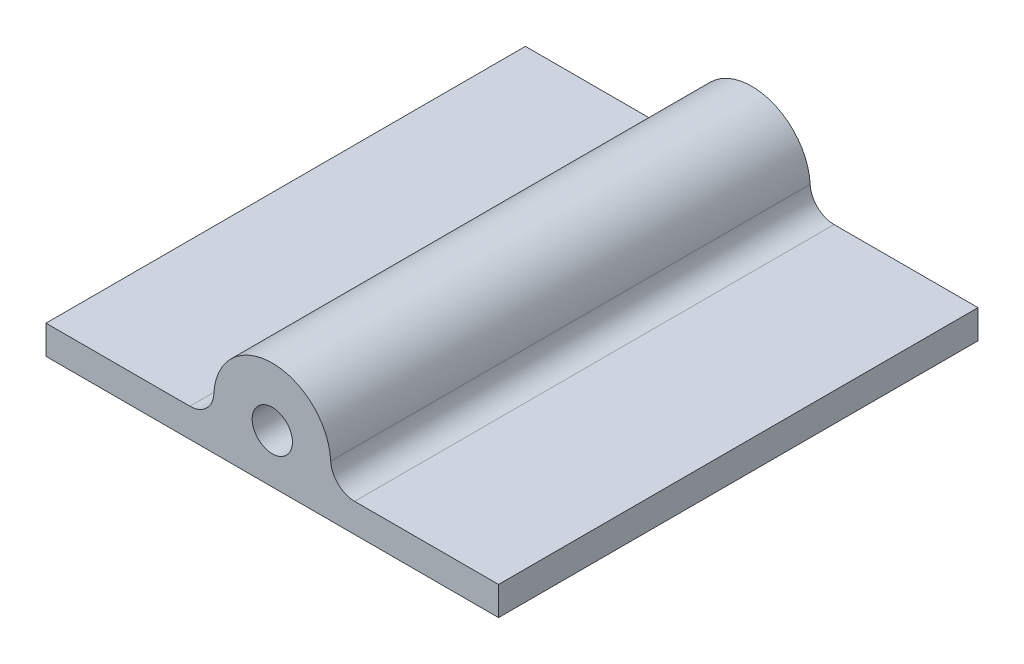
ISO-10303-21;
HEADER;
FILE_DESCRIPTION(('STEP AP214'),'2;1');
FILE_NAME('part.step','',(''),(''),'','','');
FILE_SCHEMA(('AUTOMOTIVE_DESIGN { 1 0 10303 214 1 1 1 1 }'));
ENDSEC;
DATA;
#1=APPLICATION_CONTEXT('core data for automotive mechanical design processes');
#2=APPLICATION_PROTOCOL_DEFINITION('international standard','automotive_design',2000,#1);
#3=PRODUCT_CONTEXT('',#1,'mechanical');
#4=PRODUCT('Part','Part','',(#3));
#5=PRODUCT_RELATED_PRODUCT_CATEGORY('part','',(#4));
#6=PRODUCT_DEFINITION_FORMATION('','',#4);
#7=PRODUCT_DEFINITION_CONTEXT('part definition',#1,'design');
#8=PRODUCT_DEFINITION('design','',#6,#7);
#9=PRODUCT_DEFINITION_SHAPE('','',#8);
#10=(LENGTH_UNIT() NAMED_UNIT(*) SI_UNIT(.MILLI.,.METRE.));
#11=(NAMED_UNIT(*) PLANE_ANGLE_UNIT() SI_UNIT($,.RADIAN.));
#12=(NAMED_UNIT(*) SI_UNIT($,.STERADIAN.) SOLID_ANGLE_UNIT());
#13=UNCERTAINTY_MEASURE_WITH_UNIT(LENGTH_MEASURE(1.E-05),#10,'distance_accuracy_value','');
#14=(GEOMETRIC_REPRESENTATION_CONTEXT(3) GLOBAL_UNCERTAINTY_ASSIGNED_CONTEXT((#13)) GLOBAL_UNIT_ASSIGNED_CONTEXT((#10,
#11,#12)) REPRESENTATION_CONTEXT('',''));
#15=CARTESIAN_POINT('',(0.,0.,0.));
#16=DIRECTION('',(0.,0.,1.));
#17=DIRECTION('',(1.,0.,0.));
#18=AXIS2_PLACEMENT_3D('',#15,#16,#17);
#19=CARTESIAN_POINT('',(3.24062427651735,-0.681535017659198,100.));
#20=DIRECTION('',(0.,0.,-1.));
#21=DIRECTION('',(-1.,0.,0.));
#22=AXIS2_PLACEMENT_3D('',#19,#20,#21);
#23=PLANE('',#22);
#24=CARTESIAN_POINT('',(3.24062427651735,-0.681535017659198,100.));
#25=DIRECTION('',(0.,0.,1.));
#26=DIRECTION('',(-1.,0.,0.));
#27=AXIS2_PLACEMENT_3D('',#24,#25,#26);
#28=CIRCLE('',#27,12.2);
#29=CARTESIAN_POINT('',(15.4274208094456,-0.114093157194082,100.));
#30=VERTEX_POINT('',#29);
#31=CARTESIAN_POINT('',(-8.94617225641089,-0.114093157194087,100.));
#32=VERTEX_POINT('',#31);
#33=EDGE_CURVE('E292',#30,#32,#28,.T.);
#34=ORIENTED_EDGE('',*,*,#33,.T.);
#35=CARTESIAN_POINT('',(-13.9407609994143,0.118464982340794,100.));
#36=DIRECTION('',(0.,0.,-1.));
#37=DIRECTION('',(-1.,0.,0.));
#38=AXIS2_PLACEMENT_3D('',#35,#36,#37);
#39=CIRCLE('',#38,5.);
#40=CARTESIAN_POINT('',(-13.9407609994143,-4.88153501765921,100.));
#41=VERTEX_POINT('',#40);
#42=EDGE_CURVE('E117',#32,#41,#39,.T.);
#43=ORIENTED_EDGE('',*,*,#42,.T.);
#44=DIRECTION('',(-1.,0.,0.));
#45=VECTOR('',#44,1.);
#46=CARTESIAN_POINT('',(-8.95937572348265,-4.88153501765921,100.));
#47=LINE('',#46,#45);
#48=CARTESIAN_POINT('',(-43.9593757234827,-4.88153501765921,100.));
#49=VERTEX_POINT('',#48);
#50=EDGE_CURVE('E110',#41,#49,#47,.T.);
#51=ORIENTED_EDGE('',*,*,#50,.T.);
#52=DIRECTION('',(0.,-1.,0.));
#53=VECTOR('',#52,1.);
#54=CARTESIAN_POINT('',(-43.9593757234827,-4.88153501765921,100.));
#55=LINE('',#54,#53);
#56=CARTESIAN_POINT('',(-43.9593757234827,-10.8815350176592,100.));
#57=VERTEX_POINT('',#56);
#58=EDGE_CURVE('E114',#49,#57,#55,.T.);
#59=ORIENTED_EDGE('',*,*,#58,.T.);
#60=DIRECTION('',(1.,0.,0.));
#61=VECTOR('',#60,1.);
#62=CARTESIAN_POINT('',(-43.9593757234827,-10.8815350176592,100.));
#63=LINE('',#62,#61);
#64=CARTESIAN_POINT('',(50.4406242765174,-10.8815350176592,100.));
#65=VERTEX_POINT('',#64);
#66=EDGE_CURVE('E133',#57,#65,#63,.T.);
#67=ORIENTED_EDGE('',*,*,#66,.T.);
#68=DIRECTION('',(0.,1.,0.));
#69=VECTOR('',#68,1.);
#70=CARTESIAN_POINT('',(50.4406242765174,-10.8815350176592,100.));
#71=LINE('',#70,#69);
#72=CARTESIAN_POINT('',(50.4406242765174,-4.8815350176592,100.));
#73=VERTEX_POINT('',#72);
#74=EDGE_CURVE('E282',#65,#73,#71,.T.);
#75=ORIENTED_EDGE('',*,*,#74,.T.);
#76=DIRECTION('',(-1.,0.,0.));
#77=VECTOR('',#76,1.);
#78=CARTESIAN_POINT('',(50.4406242765174,-4.8815350176592,100.));
#79=LINE('',#78,#77);
#80=CARTESIAN_POINT('',(20.422009552449,-4.8815350176592,100.));
#81=VERTEX_POINT('',#80);
#82=EDGE_CURVE('E294',#73,#81,#79,.T.);
#83=ORIENTED_EDGE('',*,*,#82,.T.);
#84=CARTESIAN_POINT('',(20.422009552449,0.118464982340802,100.));
#85=DIRECTION('',(0.,0.,-1.));
#86=DIRECTION('',(-1.,0.,0.));
#87=AXIS2_PLACEMENT_3D('',#84,#85,#86);
#88=CIRCLE('',#87,5.);
#89=EDGE_CURVE('E11',#81,#30,#88,.T.);
#90=ORIENTED_EDGE('',*,*,#89,.T.);
#91=EDGE_LOOP('',(#34,#43,#51,#59,#67,#75,#83,#90));
#92=FACE_BOUND('',#91,.T.);
#93=CARTESIAN_POINT('',(3.24062427651735,-0.681535017659198,100.));
#94=DIRECTION('',(0.,0.,1.));
#95=DIRECTION('',(1.,0.,0.));
#96=AXIS2_PLACEMENT_3D('',#93,#94,#95);
#97=CIRCLE('',#96,4.2);
#98=CARTESIAN_POINT('',(7.44062427651735,-0.681535017659198,100.));
#99=VERTEX_POINT('',#98);
#100=EDGE_CURVE('E301',#99,#99,#97,.T.);
#101=ORIENTED_EDGE('',*,*,#100,.F.);
#102=EDGE_LOOP('',(#101));
#103=FACE_BOUND('',#102,.T.);
#104=ADVANCED_FACE('F45',(#92,#103),#23,.F.);
#105=CARTESIAN_POINT('',(3.24062427651735,-0.681535017659198,0.));
#106=DIRECTION('',(0.,0.,-1.));
#107=DIRECTION('',(-1.,0.,0.));
#108=AXIS2_PLACEMENT_3D('',#105,#106,#107);
#109=PLANE('',#108);
#110=DIRECTION('',(-1.,0.,0.));
#111=VECTOR('',#110,1.);
#112=CARTESIAN_POINT('',(-8.95937572348265,-4.88153501765921,0.));
#113=LINE('',#112,#111);
#114=CARTESIAN_POINT('',(-13.9407609994143,-4.88153501765921,0.));
#115=VERTEX_POINT('',#114);
#116=CARTESIAN_POINT('',(-43.9593757234827,-4.88153501765921,0.));
#117=VERTEX_POINT('',#116);
#118=EDGE_CURVE('E137',#115,#117,#113,.T.);
#119=ORIENTED_EDGE('',*,*,#118,.F.);
#120=CARTESIAN_POINT('',(-13.9407609994143,0.118464982340794,0.));
#121=DIRECTION('',(0.,0.,-1.));
#122=DIRECTION('',(-1.,0.,0.));
#123=AXIS2_PLACEMENT_3D('',#120,#121,#122);
#124=CIRCLE('',#123,5.);
#125=CARTESIAN_POINT('',(-8.94617225641089,-0.114093157194087,0.));
#126=VERTEX_POINT('',#125);
#127=EDGE_CURVE('E158',#115,#126,#124,.F.);
#128=ORIENTED_EDGE('',*,*,#127,.T.);
#129=CARTESIAN_POINT('',(3.24062427651735,-0.681535017659198,0.));
#130=DIRECTION('',(0.,0.,1.));
#131=DIRECTION('',(-1.,0.,0.));
#132=AXIS2_PLACEMENT_3D('',#129,#130,#131);
#133=CIRCLE('',#132,12.2);
#134=CARTESIAN_POINT('',(15.4274208094456,-0.114093157194082,0.));
#135=VERTEX_POINT('',#134);
#136=EDGE_CURVE('E123',#135,#126,#133,.T.);
#137=ORIENTED_EDGE('',*,*,#136,.F.);
#138=CARTESIAN_POINT('',(20.422009552449,0.118464982340802,0.));
#139=DIRECTION('',(0.,0.,-1.));
#140=DIRECTION('',(-1.,0.,0.));
#141=AXIS2_PLACEMENT_3D('',#138,#139,#140);
#142=CIRCLE('',#141,5.);
#143=CARTESIAN_POINT('',(20.422009552449,-4.8815350176592,0.));
#144=VERTEX_POINT('',#143);
#145=EDGE_CURVE('E54',#135,#144,#142,.F.);
#146=ORIENTED_EDGE('',*,*,#145,.T.);
#147=DIRECTION('',(-1.,0.,0.));
#148=VECTOR('',#147,1.);
#149=CARTESIAN_POINT('',(50.4406242765174,-4.8815350176592,0.));
#150=LINE('',#149,#148);
#151=CARTESIAN_POINT('',(50.4406242765174,-4.8815350176592,0.));
#152=VERTEX_POINT('',#151);
#153=EDGE_CURVE('E173',#152,#144,#150,.T.);
#154=ORIENTED_EDGE('',*,*,#153,.F.);
#155=DIRECTION('',(0.,1.,0.));
#156=VECTOR('',#155,1.);
#157=CARTESIAN_POINT('',(50.4406242765174,-10.8815350176592,0.));
#158=LINE('',#157,#156);
#159=CARTESIAN_POINT('',(50.4406242765174,-10.8815350176592,0.));
#160=VERTEX_POINT('',#159);
#161=EDGE_CURVE('E277',#160,#152,#158,.T.);
#162=ORIENTED_EDGE('',*,*,#161,.F.);
#163=DIRECTION('',(1.,0.,0.));
#164=VECTOR('',#163,1.);
#165=CARTESIAN_POINT('',(-43.9593757234827,-10.8815350176592,0.));
#166=LINE('',#165,#164);
#167=CARTESIAN_POINT('',(-43.9593757234827,-10.8815350176592,0.));
#168=VERTEX_POINT('',#167);
#169=EDGE_CURVE('E272',#168,#160,#166,.T.);
#170=ORIENTED_EDGE('',*,*,#169,.F.);
#171=DIRECTION('',(0.,-1.,0.));
#172=VECTOR('',#171,1.);
#173=CARTESIAN_POINT('',(-43.9593757234827,-4.88153501765921,0.));
#174=LINE('',#173,#172);
#175=EDGE_CURVE('E278',#117,#168,#174,.T.);
#176=ORIENTED_EDGE('',*,*,#175,.F.);
#177=EDGE_LOOP('',(#119,#128,#137,#146,#154,#162,#170,#176));
#178=FACE_BOUND('',#177,.T.);
#179=CARTESIAN_POINT('',(3.24062427651735,-0.681535017659198,0.));
#180=DIRECTION('',(0.,0.,1.));
#181=DIRECTION('',(1.,0.,0.));
#182=AXIS2_PLACEMENT_3D('',#179,#180,#181);
#183=CIRCLE('',#182,4.2);
#184=CARTESIAN_POINT('',(7.44062427651735,-0.681535017659198,0.));
#185=VERTEX_POINT('',#184);
#186=EDGE_CURVE('E306',#185,#185,#183,.T.);
#187=ORIENTED_EDGE('',*,*,#186,.T.);
#188=EDGE_LOOP('',(#187));
#189=FACE_BOUND('',#188,.T.);
#190=ADVANCED_FACE('F164',(#178,#189),#109,.T.);
#191=CARTESIAN_POINT('',(-8.95937572348265,-4.88153501765921,100.));
#192=DIRECTION('',(0.,-1.,0.));
#193=DIRECTION('',(1.,0.,0.));
#194=AXIS2_PLACEMENT_3D('',#191,#192,#193);
#195=PLANE('',#194);
#196=ORIENTED_EDGE('',*,*,#50,.F.);
#197=DIRECTION('',(0.,0.,1.));
#198=VECTOR('',#197,1.);
#199=CARTESIAN_POINT('',(-13.9407609994143,-4.88153501765921,0.));
#200=LINE('',#199,#198);
#201=EDGE_CURVE('E140',#41,#115,#200,.F.);
#202=ORIENTED_EDGE('',*,*,#201,.T.);
#203=ORIENTED_EDGE('',*,*,#118,.T.);
#204=DIRECTION('',(0.,0.,-1.));
#205=VECTOR('',#204,1.);
#206=CARTESIAN_POINT('',(-43.9593757234827,-4.88153501765921,100.));
#207=LINE('',#206,#205);
#208=EDGE_CURVE('E128',#49,#117,#207,.T.);
#209=ORIENTED_EDGE('',*,*,#208,.F.);
#210=EDGE_LOOP('',(#196,#202,#203,#209));
#211=FACE_BOUND('',#210,.T.);
#212=ADVANCED_FACE('F135',(#211),#195,.F.);
#213=CARTESIAN_POINT('',(-43.9593757234827,-4.88153501765921,100.));
#214=DIRECTION('',(1.,0.,0.));
#215=DIRECTION('',(0.,0.,-1.));
#216=AXIS2_PLACEMENT_3D('',#213,#214,#215);
#217=PLANE('',#216);
#218=ORIENTED_EDGE('',*,*,#175,.T.);
#219=DIRECTION('',(0.,0.,-1.));
#220=VECTOR('',#219,1.);
#221=CARTESIAN_POINT('',(-43.9593757234827,-10.8815350176592,100.));
#222=LINE('',#221,#220);
#223=EDGE_CURVE('E130',#57,#168,#222,.T.);
#224=ORIENTED_EDGE('',*,*,#223,.F.);
#225=ORIENTED_EDGE('',*,*,#58,.F.);
#226=ORIENTED_EDGE('',*,*,#208,.T.);
#227=EDGE_LOOP('',(#218,#224,#225,#226));
#228=FACE_BOUND('',#227,.T.);
#229=ADVANCED_FACE('F127',(#228),#217,.F.);
#230=CARTESIAN_POINT('',(-43.9593757234827,-10.8815350176592,100.));
#231=DIRECTION('',(0.,1.,0.));
#232=DIRECTION('',(0.,0.,1.));
#233=AXIS2_PLACEMENT_3D('',#230,#231,#232);
#234=PLANE('',#233);
#235=ORIENTED_EDGE('',*,*,#169,.T.);
#236=DIRECTION('',(0.,0.,-1.));
#237=VECTOR('',#236,1.);
#238=CARTESIAN_POINT('',(50.4406242765174,-10.8815350176592,100.));
#239=LINE('',#238,#237);
#240=EDGE_CURVE('E146',#65,#160,#239,.T.);
#241=ORIENTED_EDGE('',*,*,#240,.F.);
#242=ORIENTED_EDGE('',*,*,#66,.F.);
#243=ORIENTED_EDGE('',*,*,#223,.T.);
#244=EDGE_LOOP('',(#235,#241,#242,#243));
#245=FACE_BOUND('',#244,.T.);
#246=ADVANCED_FACE('F201',(#245),#234,.F.);
#247=CARTESIAN_POINT('',(50.4406242765174,-10.8815350176592,100.));
#248=DIRECTION('',(-1.,0.,0.));
#249=DIRECTION('',(0.,0.,1.));
#250=AXIS2_PLACEMENT_3D('',#247,#248,#249);
#251=PLANE('',#250);
#252=ORIENTED_EDGE('',*,*,#161,.T.);
#253=DIRECTION('',(0.,0.,-1.));
#254=VECTOR('',#253,1.);
#255=CARTESIAN_POINT('',(50.4406242765174,-4.8815350176592,100.));
#256=LINE('',#255,#254);
#257=EDGE_CURVE('E284',#73,#152,#256,.T.);
#258=ORIENTED_EDGE('',*,*,#257,.F.);
#259=ORIENTED_EDGE('',*,*,#74,.F.);
#260=ORIENTED_EDGE('',*,*,#240,.T.);
#261=EDGE_LOOP('',(#252,#258,#259,#260));
#262=FACE_BOUND('',#261,.T.);
#263=ADVANCED_FACE('F198',(#262),#251,.F.);
#264=CARTESIAN_POINT('',(50.4406242765174,-4.8815350176592,100.));
#265=DIRECTION('',(0.,-1.,0.));
#266=DIRECTION('',(0.,0.,-1.));
#267=AXIS2_PLACEMENT_3D('',#264,#265,#266);
#268=PLANE('',#267);
#269=ORIENTED_EDGE('',*,*,#153,.T.);
#270=DIRECTION('',(0.,0.,1.));
#271=VECTOR('',#270,1.);
#272=CARTESIAN_POINT('',(20.422009552449,-4.8815350176592,100.));
#273=LINE('',#272,#271);
#274=EDGE_CURVE('E61',#144,#81,#273,.T.);
#275=ORIENTED_EDGE('',*,*,#274,.T.);
#276=ORIENTED_EDGE('',*,*,#82,.F.);
#277=ORIENTED_EDGE('',*,*,#257,.T.);
#278=EDGE_LOOP('',(#269,#275,#276,#277));
#279=FACE_BOUND('',#278,.T.);
#280=ADVANCED_FACE('F195',(#279),#268,.F.);
#281=CARTESIAN_POINT('',(3.24062427651735,-0.681535017659198,100.));
#282=DIRECTION('',(0.,0.,-1.));
#283=DIRECTION('',(-1.,0.,0.));
#284=AXIS2_PLACEMENT_3D('',#281,#282,#283);
#285=CYLINDRICAL_SURFACE('',#284,12.2);
#286=ORIENTED_EDGE('',*,*,#136,.T.);
#287=DIRECTION('',(0.,0.,-1.));
#288=VECTOR('',#287,1.);
#289=CARTESIAN_POINT('',(-8.9461722564109,-0.114093157194087,100.));
#290=LINE('',#289,#288);
#291=EDGE_CURVE('E153',#126,#32,#290,.F.);
#292=ORIENTED_EDGE('',*,*,#291,.T.);
#293=ORIENTED_EDGE('',*,*,#33,.F.);
#294=DIRECTION('',(0.,0.,-1.));
#295=VECTOR('',#294,1.);
#296=CARTESIAN_POINT('',(15.4274208094456,-0.114093157194082,100.));
#297=LINE('',#296,#295);
#298=EDGE_CURVE('E144',#30,#135,#297,.T.);
#299=ORIENTED_EDGE('',*,*,#298,.T.);
#300=EDGE_LOOP('',(#286,#292,#293,#299));
#301=FACE_BOUND('',#300,.T.);
#302=ADVANCED_FACE('F169',(#301),#285,.T.);
#303=CARTESIAN_POINT('',(3.24062427651735,-0.681535017659198,100.));
#304=DIRECTION('',(0.,0.,-1.));
#305=DIRECTION('',(-1.,0.,0.));
#306=AXIS2_PLACEMENT_3D('',#303,#304,#305);
#307=CYLINDRICAL_SURFACE('',#306,4.2);
#308=ORIENTED_EDGE('',*,*,#100,.T.);
#309=EDGE_LOOP('',(#308));
#310=FACE_BOUND('',#309,.T.);
#311=ORIENTED_EDGE('',*,*,#186,.F.);
#312=EDGE_LOOP('',(#311));
#313=FACE_BOUND('',#312,.T.);
#314=ADVANCED_FACE('F177',(#310,#313),#307,.F.);
#315=CARTESIAN_POINT('',(-13.9407609994143,0.118464982340794,100.));
#316=DIRECTION('',(0.,0.,-1.));
#317=DIRECTION('',(-1.,0.,0.));
#318=AXIS2_PLACEMENT_3D('',#315,#316,#317);
#319=CYLINDRICAL_SURFACE('',#318,5.);
#320=ORIENTED_EDGE('',*,*,#42,.F.);
#321=ORIENTED_EDGE('',*,*,#291,.F.);
#322=ORIENTED_EDGE('',*,*,#127,.F.);
#323=ORIENTED_EDGE('',*,*,#201,.F.);
#324=EDGE_LOOP('',(#320,#321,#322,#323));
#325=FACE_BOUND('',#324,.T.);
#326=ADVANCED_FACE('F175',(#325),#319,.F.);
#327=CARTESIAN_POINT('',(20.422009552449,0.118464982340802,100.));
#328=DIRECTION('',(0.,0.,-1.));
#329=DIRECTION('',(-1.,0.,0.));
#330=AXIS2_PLACEMENT_3D('',#327,#328,#329);
#331=CYLINDRICAL_SURFACE('',#330,5.);
#332=ORIENTED_EDGE('',*,*,#89,.F.);
#333=ORIENTED_EDGE('',*,*,#274,.F.);
#334=ORIENTED_EDGE('',*,*,#145,.F.);
#335=ORIENTED_EDGE('',*,*,#298,.F.);
#336=EDGE_LOOP('',(#332,#333,#334,#335));
#337=FACE_BOUND('',#336,.T.);
#338=ADVANCED_FACE('F47',(#337),#331,.F.);
#339=CLOSED_SHELL('',(#104,#190,#212,#229,#246,#263,#280,#302,#314,#326,#338));
#340=MANIFOLD_SOLID_BREP('B2',#339);
#341=ADVANCED_BREP_SHAPE_REPRESENTATION('',(#18,#340),#14);
#342=SHAPE_DEFINITION_REPRESENTATION(#9,#341);
ENDSEC;
END-ISO-10303-21;
